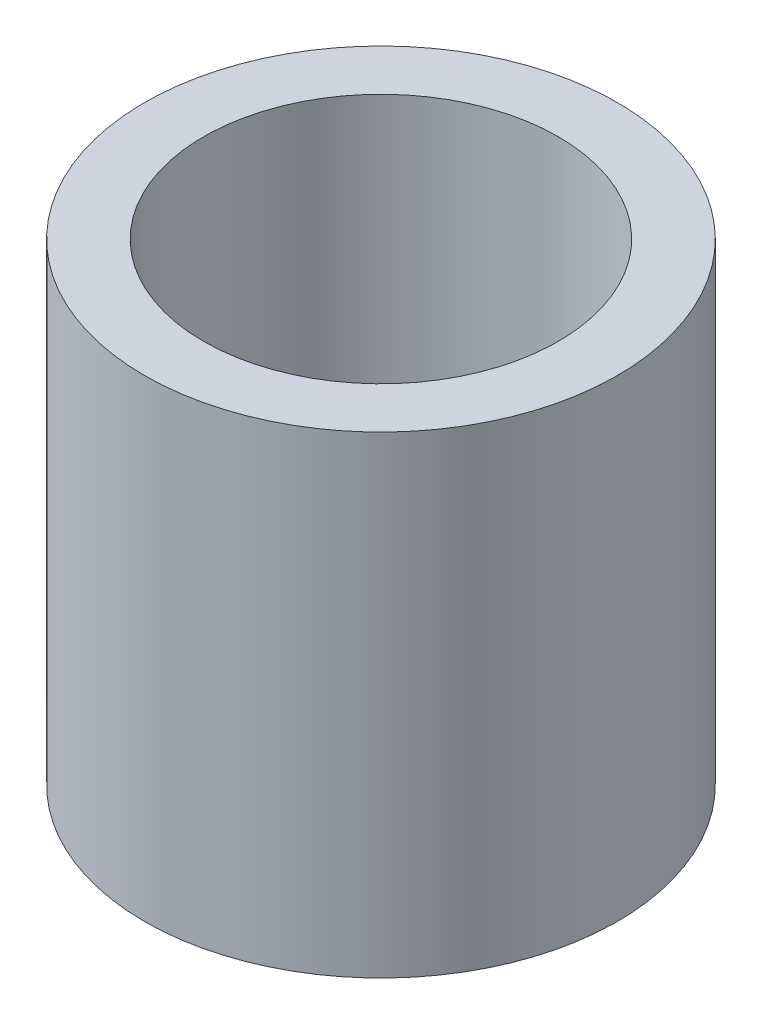
ISO-10303-21;
HEADER;
FILE_DESCRIPTION(('STEP AP214'),'2;1');
FILE_NAME('part.step','',(''),(''),'','','');
FILE_SCHEMA(('AUTOMOTIVE_DESIGN { 1 0 10303 214 1 1 1 1 }'));
ENDSEC;
DATA;
#1=APPLICATION_CONTEXT('core data for automotive mechanical design processes');
#2=APPLICATION_PROTOCOL_DEFINITION('international standard','automotive_design',2000,#1);
#3=PRODUCT_CONTEXT('',#1,'mechanical');
#4=PRODUCT('Part','Part','',(#3));
#5=PRODUCT_RELATED_PRODUCT_CATEGORY('part','',(#4));
#6=PRODUCT_DEFINITION_FORMATION('','',#4);
#7=PRODUCT_DEFINITION_CONTEXT('part definition',#1,'design');
#8=PRODUCT_DEFINITION('design','',#6,#7);
#9=PRODUCT_DEFINITION_SHAPE('','',#8);
#10=(LENGTH_UNIT() NAMED_UNIT(*) SI_UNIT(.MILLI.,.METRE.));
#11=(NAMED_UNIT(*) PLANE_ANGLE_UNIT() SI_UNIT($,.RADIAN.));
#12=(NAMED_UNIT(*) SI_UNIT($,.STERADIAN.) SOLID_ANGLE_UNIT());
#13=UNCERTAINTY_MEASURE_WITH_UNIT(LENGTH_MEASURE(1.E-05),#10,'distance_accuracy_value','');
#14=(GEOMETRIC_REPRESENTATION_CONTEXT(3) GLOBAL_UNCERTAINTY_ASSIGNED_CONTEXT((#13)) GLOBAL_UNIT_ASSIGNED_CONTEXT((#10,
#11,#12)) REPRESENTATION_CONTEXT('',''));
#15=CARTESIAN_POINT('',(0.,0.,0.));
#16=DIRECTION('',(0.,0.,1.));
#17=DIRECTION('',(1.,0.,0.));
#18=AXIS2_PLACEMENT_3D('',#15,#16,#17);
#19=CARTESIAN_POINT('',(0.,6.35,0.));
#20=DIRECTION('',(0.,1.,0.));
#21=DIRECTION('',(0.,0.,1.));
#22=AXIS2_PLACEMENT_3D('',#19,#20,#21);
#23=PLANE('',#22);
#24=CARTESIAN_POINT('',(0.,6.35,0.));
#25=DIRECTION('',(0.,1.,0.));
#26=DIRECTION('',(0.,0.,1.));
#27=AXIS2_PLACEMENT_3D('',#24,#25,#26);
#28=CIRCLE('',#27,3.175);
#29=CARTESIAN_POINT('',(0.,6.35,3.175));
#30=VERTEX_POINT('',#29);
#31=EDGE_CURVE('E10',#30,#30,#28,.T.);
#32=ORIENTED_EDGE('',*,*,#31,.T.);
#33=EDGE_LOOP('',(#32));
#34=FACE_BOUND('',#33,.T.);
#35=CARTESIAN_POINT('',(0.,6.35,0.));
#36=DIRECTION('',(0.,1.,0.));
#37=DIRECTION('',(0.,0.,1.));
#38=AXIS2_PLACEMENT_3D('',#35,#36,#37);
#39=CIRCLE('',#38,2.38125);
#40=CARTESIAN_POINT('',(0.,6.35,2.38125));
#41=VERTEX_POINT('',#40);
#42=EDGE_CURVE('E42',#41,#41,#39,.T.);
#43=ORIENTED_EDGE('',*,*,#42,.F.);
#44=EDGE_LOOP('',(#43));
#45=FACE_BOUND('',#44,.T.);
#46=ADVANCED_FACE('F31',(#34,#45),#23,.T.);
#47=CARTESIAN_POINT('',(0.,0.,0.));
#48=DIRECTION('',(0.,1.,0.));
#49=DIRECTION('',(0.,0.,1.));
#50=AXIS2_PLACEMENT_3D('',#47,#48,#49);
#51=PLANE('',#50);
#52=CARTESIAN_POINT('',(0.,0.,0.));
#53=DIRECTION('',(0.,1.,0.));
#54=DIRECTION('',(0.,0.,1.));
#55=AXIS2_PLACEMENT_3D('',#52,#53,#54);
#56=CIRCLE('',#55,3.175);
#57=CARTESIAN_POINT('',(0.,0.,3.175));
#58=VERTEX_POINT('',#57);
#59=EDGE_CURVE('E35',#58,#58,#56,.T.);
#60=ORIENTED_EDGE('',*,*,#59,.F.);
#61=EDGE_LOOP('',(#60));
#62=FACE_BOUND('',#61,.T.);
#63=CARTESIAN_POINT('',(0.,0.,0.));
#64=DIRECTION('',(0.,1.,0.));
#65=DIRECTION('',(0.,0.,1.));
#66=AXIS2_PLACEMENT_3D('',#63,#64,#65);
#67=CIRCLE('',#66,2.38125);
#68=CARTESIAN_POINT('',(0.,0.,2.38125));
#69=VERTEX_POINT('',#68);
#70=EDGE_CURVE('E44',#69,#69,#67,.T.);
#71=ORIENTED_EDGE('',*,*,#70,.T.);
#72=EDGE_LOOP('',(#71));
#73=FACE_BOUND('',#72,.T.);
#74=ADVANCED_FACE('F54',(#62,#73),#51,.F.);
#75=CARTESIAN_POINT('',(0.,6.35,0.));
#76=DIRECTION('',(0.,-1.,0.));
#77=DIRECTION('',(0.,0.,-1.));
#78=AXIS2_PLACEMENT_3D('',#75,#76,#77);
#79=CYLINDRICAL_SURFACE('',#78,3.175);
#80=ORIENTED_EDGE('',*,*,#31,.F.);
#81=EDGE_LOOP('',(#80));
#82=FACE_BOUND('',#81,.T.);
#83=ORIENTED_EDGE('',*,*,#59,.T.);
#84=EDGE_LOOP('',(#83));
#85=FACE_BOUND('',#84,.T.);
#86=ADVANCED_FACE('F33',(#82,#85),#79,.T.);
#87=CARTESIAN_POINT('',(0.,6.35,0.));
#88=DIRECTION('',(0.,-1.,0.));
#89=DIRECTION('',(0.,0.,-1.));
#90=AXIS2_PLACEMENT_3D('',#87,#88,#89);
#91=CYLINDRICAL_SURFACE('',#90,2.38125);
#92=ORIENTED_EDGE('',*,*,#42,.T.);
#93=EDGE_LOOP('',(#92));
#94=FACE_BOUND('',#93,.T.);
#95=ORIENTED_EDGE('',*,*,#70,.F.);
#96=EDGE_LOOP('',(#95));
#97=FACE_BOUND('',#96,.T.);
#98=ADVANCED_FACE('F50',(#94,#97),#91,.F.);
#99=CLOSED_SHELL('',(#46,#74,#86,#98));
#100=MANIFOLD_SOLID_BREP('B2',#99);
#101=ADVANCED_BREP_SHAPE_REPRESENTATION('',(#18,#100),#14);
#102=SHAPE_DEFINITION_REPRESENTATION(#9,#101);
ENDSEC;
END-ISO-10303-21;
